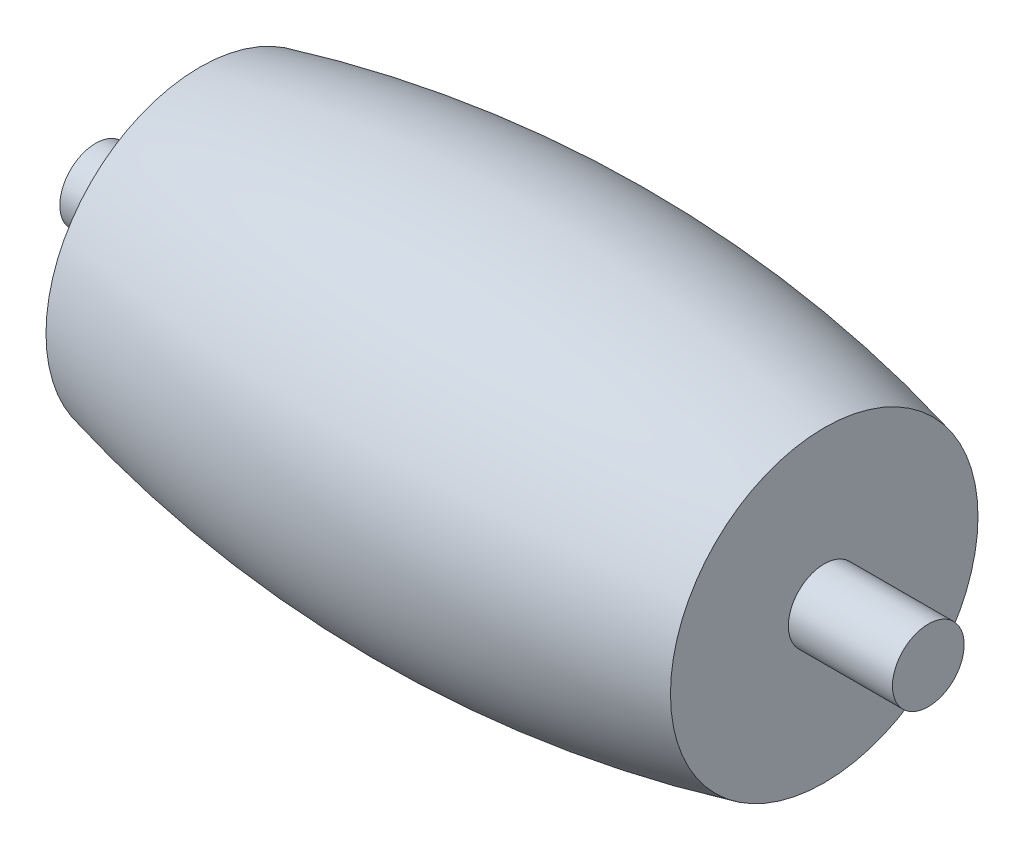
ISO-10303-21;
HEADER;
FILE_DESCRIPTION(('STEP AP214'),'2;1');
FILE_NAME('part.step','',(''),(''),'','','');
FILE_SCHEMA(('AUTOMOTIVE_DESIGN { 1 0 10303 214 1 1 1 1 }'));
ENDSEC;
DATA;
#1=APPLICATION_CONTEXT('core data for automotive mechanical design processes');
#2=APPLICATION_PROTOCOL_DEFINITION('international standard','automotive_design',2000,#1);
#3=PRODUCT_CONTEXT('',#1,'mechanical');
#4=PRODUCT('Part','Part','',(#3));
#5=PRODUCT_RELATED_PRODUCT_CATEGORY('part','',(#4));
#6=PRODUCT_DEFINITION_FORMATION('','',#4);
#7=PRODUCT_DEFINITION_CONTEXT('part definition',#1,'design');
#8=PRODUCT_DEFINITION('design','',#6,#7);
#9=PRODUCT_DEFINITION_SHAPE('','',#8);
#10=(LENGTH_UNIT() NAMED_UNIT(*) SI_UNIT(.MILLI.,.METRE.));
#11=(NAMED_UNIT(*) PLANE_ANGLE_UNIT() SI_UNIT($,.RADIAN.));
#12=(NAMED_UNIT(*) SI_UNIT($,.STERADIAN.) SOLID_ANGLE_UNIT());
#13=UNCERTAINTY_MEASURE_WITH_UNIT(LENGTH_MEASURE(1.E-05),#10,'distance_accuracy_value','');
#14=(GEOMETRIC_REPRESENTATION_CONTEXT(3) GLOBAL_UNCERTAINTY_ASSIGNED_CONTEXT((#13)) GLOBAL_UNIT_ASSIGNED_CONTEXT((#10,
#11,#12)) REPRESENTATION_CONTEXT('',''));
#15=CARTESIAN_POINT('',(0.,0.,0.));
#16=DIRECTION('',(0.,0.,1.));
#17=DIRECTION('',(1.,0.,0.));
#18=AXIS2_PLACEMENT_3D('',#15,#16,#17);
#19=CARTESIAN_POINT('',(-6.75,3.32420652015436,0.));
#20=DIRECTION('',(1.,0.,0.));
#21=DIRECTION('',(0.,0.,-1.));
#22=AXIS2_PLACEMENT_3D('',#19,#20,#21);
#23=PLANE('',#22);
#24=CARTESIAN_POINT('',(-6.75,0.,0.));
#25=DIRECTION('',(-1.,0.,0.));
#26=DIRECTION('',(0.,0.,1.));
#27=AXIS2_PLACEMENT_3D('',#24,#25,#26);
#28=CIRCLE('',#27,3.32420652015436);
#29=CARTESIAN_POINT('',(-6.75,0.,3.32420652015436));
#30=VERTEX_POINT('',#29);
#31=EDGE_CURVE('E42',#30,#30,#28,.T.);
#32=ORIENTED_EDGE('',*,*,#31,.T.);
#33=EDGE_LOOP('',(#32));
#34=FACE_BOUND('',#33,.T.);
#35=CARTESIAN_POINT('',(-6.75,0.,0.));
#36=DIRECTION('',(1.,0.,0.));
#37=DIRECTION('',(0.,0.,-1.));
#38=AXIS2_PLACEMENT_3D('',#35,#36,#37);
#39=CIRCLE('',#38,0.775);
#40=CARTESIAN_POINT('',(-6.75,0.,-0.775));
#41=VERTEX_POINT('',#40);
#42=EDGE_CURVE('E10',#41,#41,#39,.F.);
#43=ORIENTED_EDGE('',*,*,#42,.F.);
#44=EDGE_LOOP('',(#43));
#45=FACE_BOUND('',#44,.T.);
#46=ADVANCED_FACE('F31',(#34,#45),#23,.F.);
#47=CARTESIAN_POINT('',(0.,0.,0.));
#48=DIRECTION('',(-1.,0.,0.));
#49=DIRECTION('',(0.,0.,1.));
#50=AXIS2_PLACEMENT_3D('',#47,#48,#49);
#51=DEGENERATE_TOROIDAL_SURFACE('',#50,23.85,28.,.F.);
#52=ORIENTED_EDGE('',*,*,#31,.F.);
#53=EDGE_LOOP('',(#52));
#54=FACE_BOUND('',#53,.T.);
#55=CARTESIAN_POINT('',(6.75,0.,0.));
#56=DIRECTION('',(-1.,0.,0.));
#57=DIRECTION('',(0.,0.,1.));
#58=AXIS2_PLACEMENT_3D('',#55,#56,#57);
#59=CIRCLE('',#58,3.32420652015436);
#60=CARTESIAN_POINT('',(6.75,0.,3.32420652015436));
#61=VERTEX_POINT('',#60);
#62=EDGE_CURVE('E38',#61,#61,#59,.T.);
#63=ORIENTED_EDGE('',*,*,#62,.T.);
#64=EDGE_LOOP('',(#63));
#65=FACE_BOUND('',#64,.T.);
#66=ADVANCED_FACE('F33',(#54,#65),#51,.F.);
#67=CARTESIAN_POINT('',(6.75,3.32420652015436,0.));
#68=DIRECTION('',(-1.,0.,0.));
#69=DIRECTION('',(0.,0.,1.));
#70=AXIS2_PLACEMENT_3D('',#67,#68,#69);
#71=PLANE('',#70);
#72=CARTESIAN_POINT('',(6.75,0.,0.));
#73=DIRECTION('',(-1.,0.,0.));
#74=DIRECTION('',(0.,0.,1.));
#75=AXIS2_PLACEMENT_3D('',#72,#73,#74);
#76=CIRCLE('',#75,0.775);
#77=CARTESIAN_POINT('',(6.75,0.,0.775));
#78=VERTEX_POINT('',#77);
#79=EDGE_CURVE('E52',#78,#78,#76,.T.);
#80=ORIENTED_EDGE('',*,*,#79,.T.);
#81=EDGE_LOOP('',(#80));
#82=FACE_BOUND('',#81,.T.);
#83=ORIENTED_EDGE('',*,*,#62,.F.);
#84=EDGE_LOOP('',(#83));
#85=FACE_BOUND('',#84,.T.);
#86=ADVANCED_FACE('F75',(#82,#85),#71,.F.);
#87=CARTESIAN_POINT('',(-9.00000000000001,0.,0.));
#88=DIRECTION('',(1.,0.,0.));
#89=DIRECTION('',(0.,0.,-1.));
#90=AXIS2_PLACEMENT_3D('',#87,#88,#89);
#91=CYLINDRICAL_SURFACE('',#90,0.775);
#92=CARTESIAN_POINT('',(-9.00000000000001,0.,0.));
#93=DIRECTION('',(-1.,0.,0.));
#94=DIRECTION('',(0.,0.,1.));
#95=AXIS2_PLACEMENT_3D('',#92,#93,#94);
#96=CIRCLE('',#95,0.775);
#97=CARTESIAN_POINT('',(-9.00000000000001,0.,0.775));
#98=VERTEX_POINT('',#97);
#99=EDGE_CURVE('E46',#98,#98,#96,.T.);
#100=ORIENTED_EDGE('',*,*,#99,.F.);
#101=EDGE_LOOP('',(#100));
#102=FACE_BOUND('',#101,.T.);
#103=ORIENTED_EDGE('',*,*,#42,.T.);
#104=EDGE_LOOP('',(#103));
#105=FACE_BOUND('',#104,.T.);
#106=ADVANCED_FACE('F79',(#102,#105),#91,.T.);
#107=CARTESIAN_POINT('',(-9.00000000000001,0.,0.));
#108=DIRECTION('',(-1.,0.,0.));
#109=DIRECTION('',(0.,0.,1.));
#110=AXIS2_PLACEMENT_3D('',#107,#108,#109);
#111=PLANE('',#110);
#112=ORIENTED_EDGE('',*,*,#99,.T.);
#113=EDGE_LOOP('',(#112));
#114=FACE_BOUND('',#113,.T.);
#115=ADVANCED_FACE('F67',(#114),#111,.T.);
#116=CARTESIAN_POINT('',(9.00000000000001,0.,0.));
#117=DIRECTION('',(-1.,0.,0.));
#118=DIRECTION('',(0.,0.,1.));
#119=AXIS2_PLACEMENT_3D('',#116,#117,#118);
#120=CYLINDRICAL_SURFACE('',#119,0.775);
#121=CARTESIAN_POINT('',(9.00000000000001,0.,0.));
#122=DIRECTION('',(-1.,0.,0.));
#123=DIRECTION('',(0.,0.,1.));
#124=AXIS2_PLACEMENT_3D('',#121,#122,#123);
#125=CIRCLE('',#124,0.775);
#126=CARTESIAN_POINT('',(9.00000000000001,0.,0.775));
#127=VERTEX_POINT('',#126);
#128=EDGE_CURVE('E51',#127,#127,#125,.T.);
#129=ORIENTED_EDGE('',*,*,#128,.T.);
#130=EDGE_LOOP('',(#129));
#131=FACE_BOUND('',#130,.T.);
#132=ORIENTED_EDGE('',*,*,#79,.F.);
#133=EDGE_LOOP('',(#132));
#134=FACE_BOUND('',#133,.T.);
#135=ADVANCED_FACE('F58',(#131,#134),#120,.T.);
#136=CARTESIAN_POINT('',(9.00000000000001,0.,0.));
#137=DIRECTION('',(1.,0.,0.));
#138=DIRECTION('',(0.,0.,1.));
#139=AXIS2_PLACEMENT_3D('',#136,#137,#138);
#140=PLANE('',#139);
#141=ORIENTED_EDGE('',*,*,#128,.F.);
#142=EDGE_LOOP('',(#141));
#143=FACE_BOUND('',#142,.T.);
#144=ADVANCED_FACE('F61',(#143),#140,.T.);
#145=CLOSED_SHELL('',(#46,#66,#86,#106,#115,#135,#144));
#146=MANIFOLD_SOLID_BREP('B2',#145);
#147=ADVANCED_BREP_SHAPE_REPRESENTATION('',(#18,#146),#14);
#148=SHAPE_DEFINITION_REPRESENTATION(#9,#147);
ENDSEC;
END-ISO-10303-21;
